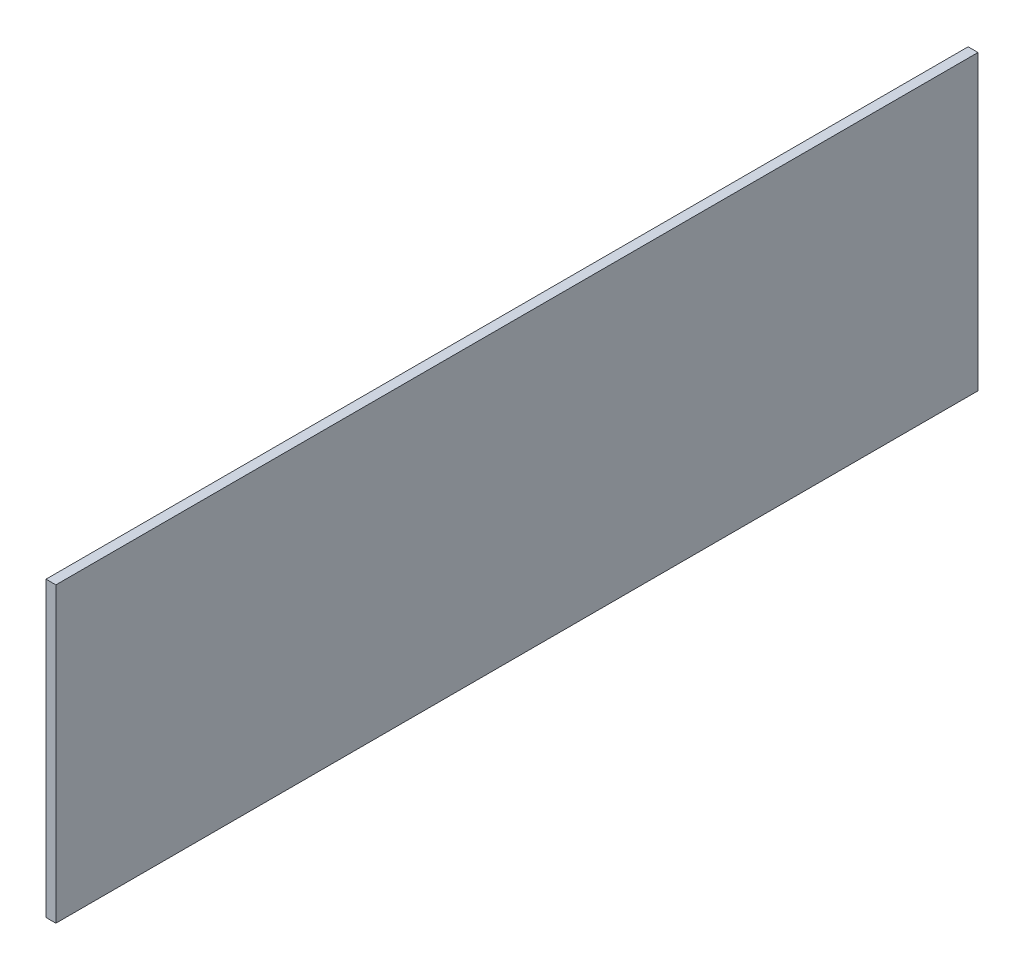
ISO-10303-21;
HEADER;
FILE_DESCRIPTION(('STEP AP214'),'2;1');
FILE_NAME('part.step','',(''),(''),'','','');
FILE_SCHEMA(('AUTOMOTIVE_DESIGN { 1 0 10303 214 1 1 1 1 }'));
ENDSEC;
DATA;
#1=APPLICATION_CONTEXT('core data for automotive mechanical design processes');
#2=APPLICATION_PROTOCOL_DEFINITION('international standard','automotive_design',2000,#1);
#3=PRODUCT_CONTEXT('',#1,'mechanical');
#4=PRODUCT('Part','Part','',(#3));
#5=PRODUCT_RELATED_PRODUCT_CATEGORY('part','',(#4));
#6=PRODUCT_DEFINITION_FORMATION('','',#4);
#7=PRODUCT_DEFINITION_CONTEXT('part definition',#1,'design');
#8=PRODUCT_DEFINITION('design','',#6,#7);
#9=PRODUCT_DEFINITION_SHAPE('','',#8);
#10=(LENGTH_UNIT() NAMED_UNIT(*) SI_UNIT(.MILLI.,.METRE.));
#11=(NAMED_UNIT(*) PLANE_ANGLE_UNIT() SI_UNIT($,.RADIAN.));
#12=(NAMED_UNIT(*) SI_UNIT($,.STERADIAN.) SOLID_ANGLE_UNIT());
#13=UNCERTAINTY_MEASURE_WITH_UNIT(LENGTH_MEASURE(1.E-05),#10,'distance_accuracy_value','');
#14=(GEOMETRIC_REPRESENTATION_CONTEXT(3) GLOBAL_UNCERTAINTY_ASSIGNED_CONTEXT((#13)) GLOBAL_UNIT_ASSIGNED_CONTEXT((#10,
#11,#12)) REPRESENTATION_CONTEXT('',''));
#15=CARTESIAN_POINT('',(0.,0.,0.));
#16=DIRECTION('',(0.,0.,1.));
#17=DIRECTION('',(1.,0.,0.));
#18=AXIS2_PLACEMENT_3D('',#15,#16,#17);
#19=CARTESIAN_POINT('',(2.9972,0.,0.));
#20=DIRECTION('',(0.,0.,-1.));
#21=DIRECTION('',(0.,1.,0.));
#22=AXIS2_PLACEMENT_3D('',#19,#20,#21);
#23=PLANE('',#22);
#24=DIRECTION('',(0.,-1.,0.));
#25=VECTOR('',#24,1.);
#26=CARTESIAN_POINT('',(0.,0.,0.));
#27=LINE('',#26,#25);
#28=CARTESIAN_POINT('',(0.,0.,0.));
#29=VERTEX_POINT('',#28);
#30=CARTESIAN_POINT('',(0.,-88.9,0.));
#31=VERTEX_POINT('',#30);
#32=EDGE_CURVE('E98',#29,#31,#27,.T.);
#33=ORIENTED_EDGE('',*,*,#32,.T.);
#34=DIRECTION('',(-1.,0.,0.));
#35=VECTOR('',#34,1.);
#36=CARTESIAN_POINT('',(2.9972,-88.9,0.));
#37=LINE('',#36,#35);
#38=CARTESIAN_POINT('',(2.9972,-88.9,0.));
#39=VERTEX_POINT('',#38);
#40=EDGE_CURVE('E11',#39,#31,#37,.T.);
#41=ORIENTED_EDGE('',*,*,#40,.F.);
#42=DIRECTION('',(0.,-1.,0.));
#43=VECTOR('',#42,1.);
#44=CARTESIAN_POINT('',(2.9972,0.,0.));
#45=LINE('',#44,#43);
#46=CARTESIAN_POINT('',(2.9972,0.,0.));
#47=VERTEX_POINT('',#46);
#48=EDGE_CURVE('E86',#47,#39,#45,.T.);
#49=ORIENTED_EDGE('',*,*,#48,.F.);
#50=DIRECTION('',(-1.,0.,0.));
#51=VECTOR('',#50,1.);
#52=CARTESIAN_POINT('',(2.9972,0.,0.));
#53=LINE('',#52,#51);
#54=EDGE_CURVE('E94',#47,#29,#53,.T.);
#55=ORIENTED_EDGE('',*,*,#54,.T.);
#56=EDGE_LOOP('',(#33,#41,#49,#55));
#57=FACE_BOUND('',#56,.T.);
#58=ADVANCED_FACE('F35',(#57),#23,.F.);
#59=CARTESIAN_POINT('',(2.9972,-88.9,0.));
#60=DIRECTION('',(0.,1.,0.));
#61=DIRECTION('',(0.,0.,1.));
#62=AXIS2_PLACEMENT_3D('',#59,#60,#61);
#63=PLANE('',#62);
#64=DIRECTION('',(0.,0.,-1.));
#65=VECTOR('',#64,1.);
#66=CARTESIAN_POINT('',(0.,-88.9,0.));
#67=LINE('',#66,#65);
#68=CARTESIAN_POINT('',(0.,-88.9,-279.7556));
#69=VERTEX_POINT('',#68);
#70=EDGE_CURVE('E90',#31,#69,#67,.T.);
#71=ORIENTED_EDGE('',*,*,#70,.T.);
#72=DIRECTION('',(-1.,0.,0.));
#73=VECTOR('',#72,1.);
#74=CARTESIAN_POINT('',(2.9972,-88.9,-279.7556));
#75=LINE('',#74,#73);
#76=CARTESIAN_POINT('',(2.9972,-88.9,-279.7556));
#77=VERTEX_POINT('',#76);
#78=EDGE_CURVE('E43',#77,#69,#75,.T.);
#79=ORIENTED_EDGE('',*,*,#78,.F.);
#80=DIRECTION('',(0.,0.,-1.));
#81=VECTOR('',#80,1.);
#82=CARTESIAN_POINT('',(2.9972,-88.9,0.));
#83=LINE('',#82,#81);
#84=EDGE_CURVE('E81',#39,#77,#83,.T.);
#85=ORIENTED_EDGE('',*,*,#84,.F.);
#86=ORIENTED_EDGE('',*,*,#40,.T.);
#87=EDGE_LOOP('',(#71,#79,#85,#86));
#88=FACE_BOUND('',#87,.T.);
#89=ADVANCED_FACE('F89',(#88),#63,.F.);
#90=CARTESIAN_POINT('',(2.9972,0.,-279.7556));
#91=DIRECTION('',(0.,0.,1.));
#92=DIRECTION('',(1.,0.,0.));
#93=AXIS2_PLACEMENT_3D('',#90,#91,#92);
#94=PLANE('',#93);
#95=DIRECTION('',(0.,1.,0.));
#96=VECTOR('',#95,1.);
#97=CARTESIAN_POINT('',(0.,0.,-279.7556));
#98=LINE('',#97,#96);
#99=CARTESIAN_POINT('',(0.,0.,-279.7556));
#100=VERTEX_POINT('',#99);
#101=EDGE_CURVE('E68',#69,#100,#98,.T.);
#102=ORIENTED_EDGE('',*,*,#101,.T.);
#103=DIRECTION('',(-1.,0.,0.));
#104=VECTOR('',#103,1.);
#105=CARTESIAN_POINT('',(2.9972,0.,-279.7556));
#106=LINE('',#105,#104);
#107=CARTESIAN_POINT('',(2.9972,0.,-279.7556));
#108=VERTEX_POINT('',#107);
#109=EDGE_CURVE('E91',#108,#100,#106,.T.);
#110=ORIENTED_EDGE('',*,*,#109,.F.);
#111=DIRECTION('',(0.,1.,0.));
#112=VECTOR('',#111,1.);
#113=CARTESIAN_POINT('',(2.9972,0.,-279.7556));
#114=LINE('',#113,#112);
#115=EDGE_CURVE('E84',#77,#108,#114,.T.);
#116=ORIENTED_EDGE('',*,*,#115,.F.);
#117=ORIENTED_EDGE('',*,*,#78,.T.);
#118=EDGE_LOOP('',(#102,#110,#116,#117));
#119=FACE_BOUND('',#118,.T.);
#120=ADVANCED_FACE('F92',(#119),#94,.F.);
#121=CARTESIAN_POINT('',(2.9972,0.,0.));
#122=DIRECTION('',(0.,-1.,0.));
#123=DIRECTION('',(0.,0.,-1.));
#124=AXIS2_PLACEMENT_3D('',#121,#122,#123);
#125=PLANE('',#124);
#126=DIRECTION('',(0.,0.,1.));
#127=VECTOR('',#126,1.);
#128=CARTESIAN_POINT('',(0.,0.,0.));
#129=LINE('',#128,#127);
#130=EDGE_CURVE('E74',#100,#29,#129,.T.);
#131=ORIENTED_EDGE('',*,*,#130,.T.);
#132=ORIENTED_EDGE('',*,*,#54,.F.);
#133=DIRECTION('',(0.,0.,1.));
#134=VECTOR('',#133,1.);
#135=CARTESIAN_POINT('',(2.9972,0.,0.));
#136=LINE('',#135,#134);
#137=EDGE_CURVE('E51',#108,#47,#136,.T.);
#138=ORIENTED_EDGE('',*,*,#137,.F.);
#139=ORIENTED_EDGE('',*,*,#109,.T.);
#140=EDGE_LOOP('',(#131,#132,#138,#139));
#141=FACE_BOUND('',#140,.T.);
#142=ADVANCED_FACE('F105',(#141),#125,.F.);
#143=CARTESIAN_POINT('',(2.9972,0.,0.));
#144=DIRECTION('',(1.,0.,0.));
#145=DIRECTION('',(0.,0.,-1.));
#146=AXIS2_PLACEMENT_3D('',#143,#144,#145);
#147=PLANE('',#146);
#148=ORIENTED_EDGE('',*,*,#48,.T.);
#149=ORIENTED_EDGE('',*,*,#84,.T.);
#150=ORIENTED_EDGE('',*,*,#115,.T.);
#151=ORIENTED_EDGE('',*,*,#137,.T.);
#152=EDGE_LOOP('',(#148,#149,#150,#151));
#153=FACE_BOUND('',#152,.T.);
#154=ADVANCED_FACE('F82',(#153),#147,.T.);
#155=CARTESIAN_POINT('',(0.,0.,0.));
#156=DIRECTION('',(1.,0.,0.));
#157=DIRECTION('',(0.,0.,-1.));
#158=AXIS2_PLACEMENT_3D('',#155,#156,#157);
#159=PLANE('',#158);
#160=ORIENTED_EDGE('',*,*,#32,.F.);
#161=ORIENTED_EDGE('',*,*,#130,.F.);
#162=ORIENTED_EDGE('',*,*,#101,.F.);
#163=ORIENTED_EDGE('',*,*,#70,.F.);
#164=EDGE_LOOP('',(#160,#161,#162,#163));
#165=FACE_BOUND('',#164,.T.);
#166=ADVANCED_FACE('F108',(#165),#159,.F.);
#167=CLOSED_SHELL('',(#58,#89,#120,#142,#154,#166));
#168=MANIFOLD_SOLID_BREP('B2',#167);
#169=ADVANCED_BREP_SHAPE_REPRESENTATION('',(#18,#168),#14);
#170=SHAPE_DEFINITION_REPRESENTATION(#9,#169);
ENDSEC;
END-ISO-10303-21;
